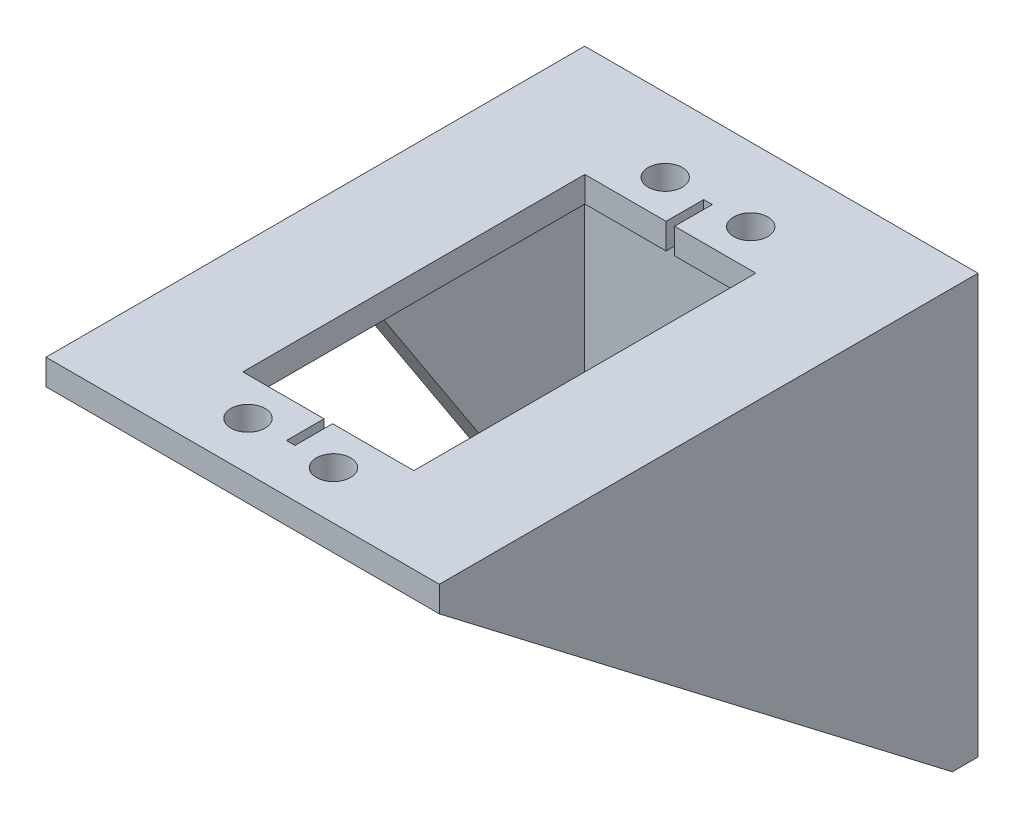
ISO-10303-21;
HEADER;
FILE_DESCRIPTION(('STEP AP214'),'2;1');
FILE_NAME('part.step','',(''),(''),'','','');
FILE_SCHEMA(('AUTOMOTIVE_DESIGN { 1 0 10303 214 1 1 1 1 }'));
ENDSEC;
DATA;
#1=APPLICATION_CONTEXT('core data for automotive mechanical design processes');
#2=APPLICATION_PROTOCOL_DEFINITION('international standard','automotive_design',2000,#1);
#3=PRODUCT_CONTEXT('',#1,'mechanical');
#4=PRODUCT('Part','Part','',(#3));
#5=PRODUCT_RELATED_PRODUCT_CATEGORY('part','',(#4));
#6=PRODUCT_DEFINITION_FORMATION('','',#4);
#7=PRODUCT_DEFINITION_CONTEXT('part definition',#1,'design');
#8=PRODUCT_DEFINITION('design','',#6,#7);
#9=PRODUCT_DEFINITION_SHAPE('','',#8);
#10=(LENGTH_UNIT() NAMED_UNIT(*) SI_UNIT(.MILLI.,.METRE.));
#11=(NAMED_UNIT(*) PLANE_ANGLE_UNIT() SI_UNIT($,.RADIAN.));
#12=(NAMED_UNIT(*) SI_UNIT($,.STERADIAN.) SOLID_ANGLE_UNIT());
#13=UNCERTAINTY_MEASURE_WITH_UNIT(LENGTH_MEASURE(1.E-05),#10,'distance_accuracy_value','');
#14=(GEOMETRIC_REPRESENTATION_CONTEXT(3) GLOBAL_UNCERTAINTY_ASSIGNED_CONTEXT((#13)) GLOBAL_UNIT_ASSIGNED_CONTEXT((#10,
#11,#12)) REPRESENTATION_CONTEXT('',''));
#15=CARTESIAN_POINT('',(0.,0.,0.));
#16=DIRECTION('',(0.,0.,1.));
#17=DIRECTION('',(1.,0.,0.));
#18=AXIS2_PLACEMENT_3D('',#15,#16,#17);
#19=CARTESIAN_POINT('',(0.,0.,3.));
#20=DIRECTION('',(1.,0.,0.));
#21=DIRECTION('',(0.,0.,-1.));
#22=AXIS2_PLACEMENT_3D('',#19,#20,#21);
#23=PLANE('',#22);
#24=DIRECTION('',(0.,0.,-1.));
#25=VECTOR('',#24,1.);
#26=CARTESIAN_POINT('',(0.,0.,3.));
#27=LINE('',#26,#25);
#28=CARTESIAN_POINT('',(0.,0.,3.));
#29=VERTEX_POINT('',#28);
#30=CARTESIAN_POINT('',(0.,0.,0.));
#31=VERTEX_POINT('',#30);
#32=EDGE_CURVE('E628',#29,#31,#27,.T.);
#33=ORIENTED_EDGE('',*,*,#32,.F.);
#34=DIRECTION('',(0.,-0.837610596838614,-0.546267780546922));
#35=VECTOR('',#34,1.);
#36=CARTESIAN_POINT('',(0.,0.,3.));
#37=LINE('',#36,#35);
#38=CARTESIAN_POINT('',(0.,46.,33.));
#39=VERTEX_POINT('',#38);
#40=EDGE_CURVE('E397',#39,#29,#37,.T.);
#41=ORIENTED_EDGE('',*,*,#40,.F.);
#42=DIRECTION('',(0.,0.,1.));
#43=VECTOR('',#42,1.);
#44=CARTESIAN_POINT('',(0.,46.,0.));
#45=LINE('',#44,#43);
#46=CARTESIAN_POINT('',(0.,46.,63.));
#47=VERTEX_POINT('',#46);
#48=EDGE_CURVE('E558',#39,#47,#45,.T.);
#49=ORIENTED_EDGE('',*,*,#48,.T.);
#50=DIRECTION('',(0.,-1.,0.));
#51=VECTOR('',#50,1.);
#52=CARTESIAN_POINT('',(0.,46.,63.));
#53=LINE('',#52,#51);
#54=CARTESIAN_POINT('',(0.,49.,63.));
#55=VERTEX_POINT('',#54);
#56=EDGE_CURVE('E549',#55,#47,#53,.T.);
#57=ORIENTED_EDGE('',*,*,#56,.F.);
#58=DIRECTION('',(0.,0.,1.));
#59=VECTOR('',#58,1.);
#60=CARTESIAN_POINT('',(0.,49.,0.));
#61=LINE('',#60,#59);
#62=CARTESIAN_POINT('',(0.,49.,0.));
#63=VERTEX_POINT('',#62);
#64=EDGE_CURVE('E562',#63,#55,#61,.T.);
#65=ORIENTED_EDGE('',*,*,#64,.F.);
#66=DIRECTION('',(0.,-1.,0.));
#67=VECTOR('',#66,1.);
#68=CARTESIAN_POINT('',(0.,0.,0.));
#69=LINE('',#68,#67);
#70=EDGE_CURVE('E612',#63,#31,#69,.T.);
#71=ORIENTED_EDGE('',*,*,#70,.T.);
#72=EDGE_LOOP('',(#33,#41,#49,#57,#65,#71));
#73=FACE_BOUND('',#72,.T.);
#74=ADVANCED_FACE('F201',(#73),#23,.F.);
#75=CARTESIAN_POINT('',(0.,0.,3.));
#76=DIRECTION('',(0.,1.,0.));
#77=DIRECTION('',(0.,0.,1.));
#78=AXIS2_PLACEMENT_3D('',#75,#76,#77);
#79=PLANE('',#78);
#80=DIRECTION('',(1.,0.,0.));
#81=VECTOR('',#80,1.);
#82=CARTESIAN_POINT('',(-3.,0.,3.));
#83=LINE('',#82,#81);
#84=CARTESIAN_POINT('',(3.,0.,3.));
#85=VERTEX_POINT('',#84);
#86=EDGE_CURVE('E411',#29,#85,#83,.T.);
#87=ORIENTED_EDGE('',*,*,#86,.F.);
#88=ORIENTED_EDGE('',*,*,#32,.T.);
#89=DIRECTION('',(1.,0.,0.));
#90=VECTOR('',#89,1.);
#91=CARTESIAN_POINT('',(0.,0.,0.));
#92=LINE('',#91,#90);
#93=CARTESIAN_POINT('',(46.,0.,0.));
#94=VERTEX_POINT('',#93);
#95=EDGE_CURVE('E616',#31,#94,#92,.T.);
#96=ORIENTED_EDGE('',*,*,#95,.T.);
#97=DIRECTION('',(0.,0.,-1.));
#98=VECTOR('',#97,1.);
#99=CARTESIAN_POINT('',(46.,0.,3.));
#100=LINE('',#99,#98);
#101=CARTESIAN_POINT('',(46.,0.,3.));
#102=VERTEX_POINT('',#101);
#103=EDGE_CURVE('E596',#102,#94,#100,.T.);
#104=ORIENTED_EDGE('',*,*,#103,.F.);
#105=CARTESIAN_POINT('',(43.,0.,3.));
#106=VERTEX_POINT('',#105);
#107=EDGE_CURVE('E408',#106,#102,#83,.T.);
#108=ORIENTED_EDGE('',*,*,#107,.F.);
#109=DIRECTION('',(1.,0.,0.));
#110=VECTOR('',#109,1.);
#111=CARTESIAN_POINT('',(0.,0.,3.));
#112=LINE('',#111,#110);
#113=EDGE_CURVE('E585',#85,#106,#112,.T.);
#114=ORIENTED_EDGE('',*,*,#113,.F.);
#115=EDGE_LOOP('',(#87,#88,#96,#104,#108,#114));
#116=FACE_BOUND('',#115,.T.);
#117=ADVANCED_FACE('F715',(#116),#79,.F.);
#118=CARTESIAN_POINT('',(46.,0.,3.));
#119=DIRECTION('',(-1.,0.,0.));
#120=DIRECTION('',(0.,0.,1.));
#121=AXIS2_PLACEMENT_3D('',#118,#119,#120);
#122=PLANE('',#121);
#123=DIRECTION('',(0.,0.608431543657136,0.793606361291916));
#124=VECTOR('',#123,1.);
#125=CARTESIAN_POINT('',(46.,0.,3.));
#126=LINE('',#125,#124);
#127=CARTESIAN_POINT('',(46.,46.,63.));
#128=VERTEX_POINT('',#127);
#129=EDGE_CURVE('E420',#102,#128,#126,.T.);
#130=ORIENTED_EDGE('',*,*,#129,.F.);
#131=ORIENTED_EDGE('',*,*,#103,.T.);
#132=DIRECTION('',(0.,1.,0.));
#133=VECTOR('',#132,1.);
#134=CARTESIAN_POINT('',(46.,0.,0.));
#135=LINE('',#134,#133);
#136=CARTESIAN_POINT('',(46.,49.,0.));
#137=VERTEX_POINT('',#136);
#138=EDGE_CURVE('E620',#94,#137,#135,.T.);
#139=ORIENTED_EDGE('',*,*,#138,.T.);
#140=DIRECTION('',(0.,0.,1.));
#141=VECTOR('',#140,1.);
#142=CARTESIAN_POINT('',(46.,49.,0.));
#143=LINE('',#142,#141);
#144=CARTESIAN_POINT('',(46.,49.,63.));
#145=VERTEX_POINT('',#144);
#146=EDGE_CURVE('E557',#137,#145,#143,.T.);
#147=ORIENTED_EDGE('',*,*,#146,.T.);
#148=DIRECTION('',(0.,1.,0.));
#149=VECTOR('',#148,1.);
#150=CARTESIAN_POINT('',(46.,49.,63.));
#151=LINE('',#150,#149);
#152=EDGE_CURVE('E541',#128,#145,#151,.T.);
#153=ORIENTED_EDGE('',*,*,#152,.F.);
#154=EDGE_LOOP('',(#130,#131,#139,#147,#153));
#155=FACE_BOUND('',#154,.T.);
#156=ADVANCED_FACE('F722',(#155),#122,.F.);
#157=CARTESIAN_POINT('',(0.,0.,63.));
#158=DIRECTION('',(0.,0.,-1.));
#159=DIRECTION('',(-1.,0.,0.));
#160=AXIS2_PLACEMENT_3D('',#157,#158,#159);
#161=PLANE('',#160);
#162=DIRECTION('',(1.,0.,0.));
#163=VECTOR('',#162,1.);
#164=CARTESIAN_POINT('',(-3.,46.,63.));
#165=LINE('',#164,#163);
#166=CARTESIAN_POINT('',(43.,46.,63.));
#167=VERTEX_POINT('',#166);
#168=EDGE_CURVE('E412',#167,#128,#165,.T.);
#169=ORIENTED_EDGE('',*,*,#168,.T.);
#170=ORIENTED_EDGE('',*,*,#152,.T.);
#171=DIRECTION('',(-1.,0.,0.));
#172=VECTOR('',#171,1.);
#173=CARTESIAN_POINT('',(0.,49.,63.));
#174=LINE('',#173,#172);
#175=EDGE_CURVE('E545',#145,#55,#174,.T.);
#176=ORIENTED_EDGE('',*,*,#175,.T.);
#177=ORIENTED_EDGE('',*,*,#56,.T.);
#178=DIRECTION('',(1.,0.,0.));
#179=VECTOR('',#178,1.);
#180=CARTESIAN_POINT('',(0.,46.,63.));
#181=LINE('',#180,#179);
#182=EDGE_CURVE('E537',#47,#167,#181,.T.);
#183=ORIENTED_EDGE('',*,*,#182,.T.);
#184=EDGE_LOOP('',(#169,#170,#176,#177,#183));
#185=FACE_BOUND('',#184,.T.);
#186=ADVANCED_FACE('F770',(#185),#161,.F.);
#187=CARTESIAN_POINT('',(43.,0.,0.));
#188=DIRECTION('',(-1.,0.,0.));
#189=DIRECTION('',(0.,0.,1.));
#190=AXIS2_PLACEMENT_3D('',#187,#188,#189);
#191=PLANE('',#190);
#192=DIRECTION('',(0.,1.,0.));
#193=VECTOR('',#192,1.);
#194=CARTESIAN_POINT('',(43.,0.,3.));
#195=LINE('',#194,#193);
#196=CARTESIAN_POINT('',(43.,46.,3.));
#197=VERTEX_POINT('',#196);
#198=EDGE_CURVE('E438',#106,#197,#195,.T.);
#199=ORIENTED_EDGE('',*,*,#198,.F.);
#200=DIRECTION('',(0.,0.608431543657136,0.793606361291916));
#201=VECTOR('',#200,1.);
#202=CARTESIAN_POINT('',(43.,-1.44856543037089,1.11056682995102));
#203=LINE('',#202,#201);
#204=EDGE_CURVE('E416',#106,#167,#203,.T.);
#205=ORIENTED_EDGE('',*,*,#204,.T.);
#206=DIRECTION('',(0.,0.,1.));
#207=VECTOR('',#206,1.);
#208=CARTESIAN_POINT('',(43.,46.,0.));
#209=LINE('',#208,#207);
#210=EDGE_CURVE('E434',#197,#167,#209,.T.);
#211=ORIENTED_EDGE('',*,*,#210,.F.);
#212=EDGE_LOOP('',(#199,#205,#211));
#213=FACE_BOUND('',#212,.T.);
#214=ADVANCED_FACE('F775',(#213),#191,.T.);
#215=CARTESIAN_POINT('',(3.,0.,0.));
#216=DIRECTION('',(-1.,0.,0.));
#217=DIRECTION('',(0.,0.,1.));
#218=AXIS2_PLACEMENT_3D('',#215,#216,#217);
#219=PLANE('',#218);
#220=DIRECTION('',(0.,0.,1.));
#221=VECTOR('',#220,1.);
#222=CARTESIAN_POINT('',(3.,46.,0.));
#223=LINE('',#222,#221);
#224=CARTESIAN_POINT('',(3.,46.,3.));
#225=VERTEX_POINT('',#224);
#226=CARTESIAN_POINT('',(3.,46.,33.));
#227=VERTEX_POINT('',#226);
#228=EDGE_CURVE('E423',#225,#227,#223,.T.);
#229=ORIENTED_EDGE('',*,*,#228,.T.);
#230=DIRECTION('',(0.,-0.837610596838614,-0.546267780546922));
#231=VECTOR('',#230,1.);
#232=CARTESIAN_POINT('',(3.,-1.37267904509284,2.10477453580902));
#233=LINE('',#232,#231);
#234=EDGE_CURVE('E404',#227,#85,#233,.T.);
#235=ORIENTED_EDGE('',*,*,#234,.T.);
#236=DIRECTION('',(0.,1.,0.));
#237=VECTOR('',#236,1.);
#238=CARTESIAN_POINT('',(3.,0.,3.));
#239=LINE('',#238,#237);
#240=EDGE_CURVE('E430',#85,#225,#239,.T.);
#241=ORIENTED_EDGE('',*,*,#240,.T.);
#242=EDGE_LOOP('',(#229,#235,#241));
#243=FACE_BOUND('',#242,.T.);
#244=ADVANCED_FACE('F805',(#243),#219,.F.);
#245=CARTESIAN_POINT('',(0.,46.,0.));
#246=DIRECTION('',(0.,-1.,0.));
#247=DIRECTION('',(0.,0.,-1.));
#248=AXIS2_PLACEMENT_3D('',#245,#246,#247);
#249=PLANE('',#248);
#250=DIRECTION('',(-1.,0.,0.));
#251=VECTOR('',#250,1.);
#252=CARTESIAN_POINT('',(0.,46.,33.));
#253=LINE('',#252,#251);
#254=EDGE_CURVE('E427',#227,#39,#253,.T.);
#255=ORIENTED_EDGE('',*,*,#254,.F.);
#256=ORIENTED_EDGE('',*,*,#228,.F.);
#257=DIRECTION('',(-1.,0.,0.));
#258=VECTOR('',#257,1.);
#259=CARTESIAN_POINT('',(0.,46.,3.));
#260=LINE('',#259,#258);
#261=EDGE_CURVE('E588',#197,#225,#260,.T.);
#262=ORIENTED_EDGE('',*,*,#261,.F.);
#263=ORIENTED_EDGE('',*,*,#210,.T.);
#264=ORIENTED_EDGE('',*,*,#182,.F.);
#265=ORIENTED_EDGE('',*,*,#48,.F.);
#266=EDGE_LOOP('',(#255,#256,#262,#263,#264,#265));
#267=FACE_BOUND('',#266,.T.);
#268=CARTESIAN_POINT('',(18.,46.,8.58105442526561));
#269=DIRECTION('',(0.,-1.,0.));
#270=DIRECTION('',(0.,0.,-1.));
#271=AXIS2_PLACEMENT_3D('',#268,#269,#270);
#272=CIRCLE('',#271,2.);
#273=CARTESIAN_POINT('',(18.,46.,6.5810544252656));
#274=VERTEX_POINT('',#273);
#275=EDGE_CURVE('E525',#274,#274,#272,.T.);
#276=ORIENTED_EDGE('',*,*,#275,.F.);
#277=EDGE_LOOP('',(#276));
#278=FACE_BOUND('',#277,.T.);
#279=CARTESIAN_POINT('',(28.,46.,57.3810544252656));
#280=DIRECTION('',(0.,-1.,0.));
#281=DIRECTION('',(0.,0.,-1.));
#282=AXIS2_PLACEMENT_3D('',#279,#280,#281);
#283=CIRCLE('',#282,2.);
#284=CARTESIAN_POINT('',(28.,46.,55.3810544252656));
#285=VERTEX_POINT('',#284);
#286=EDGE_CURVE('E442',#285,#285,#283,.F.);
#287=ORIENTED_EDGE('',*,*,#286,.T.);
#288=EDGE_LOOP('',(#287));
#289=FACE_BOUND('',#288,.T.);
#290=DIRECTION('',(0.,0.,1.));
#291=VECTOR('',#290,1.);
#292=CARTESIAN_POINT('',(23.5,46.,0.));
#293=LINE('',#292,#291);
#294=CARTESIAN_POINT('',(23.5,46.,8.58105442526561));
#295=VERTEX_POINT('',#294);
#296=CARTESIAN_POINT('',(23.5,46.,12.9810544252656));
#297=VERTEX_POINT('',#296);
#298=EDGE_CURVE('E446',#295,#297,#293,.T.);
#299=ORIENTED_EDGE('',*,*,#298,.F.);
#300=DIRECTION('',(1.,0.,0.));
#301=VECTOR('',#300,1.);
#302=CARTESIAN_POINT('',(0.,46.,8.58105442526561));
#303=LINE('',#302,#301);
#304=CARTESIAN_POINT('',(22.5,46.,8.58105442526561));
#305=VERTEX_POINT('',#304);
#306=EDGE_CURVE('E482',#305,#295,#303,.T.);
#307=ORIENTED_EDGE('',*,*,#306,.F.);
#308=DIRECTION('',(0.,0.,-1.));
#309=VECTOR('',#308,1.);
#310=CARTESIAN_POINT('',(22.5,46.,0.));
#311=LINE('',#310,#309);
#312=CARTESIAN_POINT('',(22.5,46.,12.9810544252656));
#313=VERTEX_POINT('',#312);
#314=EDGE_CURVE('E478',#313,#305,#311,.T.);
#315=ORIENTED_EDGE('',*,*,#314,.F.);
#316=DIRECTION('',(-1.,0.,0.));
#317=VECTOR('',#316,1.);
#318=CARTESIAN_POINT('',(0.,46.,12.9810544252656));
#319=LINE('',#318,#317);
#320=CARTESIAN_POINT('',(13.,46.,12.9810544252656));
#321=VERTEX_POINT('',#320);
#322=EDGE_CURVE('E454',#313,#321,#319,.T.);
#323=ORIENTED_EDGE('',*,*,#322,.T.);
#324=DIRECTION('',(0.,0.,-1.));
#325=VECTOR('',#324,1.);
#326=CARTESIAN_POINT('',(13.,46.,0.));
#327=LINE('',#326,#325);
#328=CARTESIAN_POINT('',(13.,46.,52.9810544252656));
#329=VERTEX_POINT('',#328);
#330=EDGE_CURVE('E475',#329,#321,#327,.T.);
#331=ORIENTED_EDGE('',*,*,#330,.F.);
#332=DIRECTION('',(1.,0.,0.));
#333=VECTOR('',#332,1.);
#334=CARTESIAN_POINT('',(0.,46.,52.9810544252656));
#335=LINE('',#334,#333);
#336=CARTESIAN_POINT('',(22.5,46.,52.9810544252656));
#337=VERTEX_POINT('',#336);
#338=EDGE_CURVE('E463',#329,#337,#335,.T.);
#339=ORIENTED_EDGE('',*,*,#338,.T.);
#340=DIRECTION('',(0.,0.,1.));
#341=VECTOR('',#340,1.);
#342=CARTESIAN_POINT('',(22.5,46.,0.));
#343=LINE('',#342,#341);
#344=CARTESIAN_POINT('',(22.5,46.,57.3810544252656));
#345=VERTEX_POINT('',#344);
#346=EDGE_CURVE('E471',#337,#345,#343,.T.);
#347=ORIENTED_EDGE('',*,*,#346,.T.);
#348=DIRECTION('',(1.,0.,0.));
#349=VECTOR('',#348,1.);
#350=CARTESIAN_POINT('',(0.,46.,57.3810544252656));
#351=LINE('',#350,#349);
#352=CARTESIAN_POINT('',(23.5,46.,57.3810544252656));
#353=VERTEX_POINT('',#352);
#354=EDGE_CURVE('E467',#345,#353,#351,.T.);
#355=ORIENTED_EDGE('',*,*,#354,.T.);
#356=DIRECTION('',(0.,0.,-1.));
#357=VECTOR('',#356,1.);
#358=CARTESIAN_POINT('',(23.5,46.,0.));
#359=LINE('',#358,#357);
#360=CARTESIAN_POINT('',(23.5,46.,52.9810544252656));
#361=VERTEX_POINT('',#360);
#362=EDGE_CURVE('E462',#353,#361,#359,.T.);
#363=ORIENTED_EDGE('',*,*,#362,.T.);
#364=CARTESIAN_POINT('',(33.,46.,52.9810544252656));
#365=VERTEX_POINT('',#364);
#366=EDGE_CURVE('E458',#361,#365,#335,.T.);
#367=ORIENTED_EDGE('',*,*,#366,.T.);
#368=DIRECTION('',(0.,0.,1.));
#369=VECTOR('',#368,1.);
#370=CARTESIAN_POINT('',(33.,46.,0.));
#371=LINE('',#370,#369);
#372=CARTESIAN_POINT('',(33.,46.,12.9810544252656));
#373=VERTEX_POINT('',#372);
#374=EDGE_CURVE('E453',#373,#365,#371,.T.);
#375=ORIENTED_EDGE('',*,*,#374,.F.);
#376=EDGE_CURVE('E449',#373,#297,#319,.T.);
#377=ORIENTED_EDGE('',*,*,#376,.T.);
#378=EDGE_LOOP('',(#299,#307,#315,#323,#331,#339,#347,#355,#363,#367,#375,#377));
#379=FACE_BOUND('',#378,.T.);
#380=CARTESIAN_POINT('',(28.,46.,8.58105442526561));
#381=DIRECTION('',(0.,-1.,0.));
#382=DIRECTION('',(0.,0.,-1.));
#383=AXIS2_PLACEMENT_3D('',#380,#381,#382);
#384=CIRCLE('',#383,2.);
#385=CARTESIAN_POINT('',(28.,46.,6.58105442526561));
#386=VERTEX_POINT('',#385);
#387=EDGE_CURVE('E529',#386,#386,#384,.T.);
#388=ORIENTED_EDGE('',*,*,#387,.F.);
#389=EDGE_LOOP('',(#388));
#390=FACE_BOUND('',#389,.T.);
#391=CARTESIAN_POINT('',(18.,46.,57.3810544252656));
#392=DIRECTION('',(0.,-1.,0.));
#393=DIRECTION('',(0.,0.,-1.));
#394=AXIS2_PLACEMENT_3D('',#391,#392,#393);
#395=CIRCLE('',#394,2.);
#396=CARTESIAN_POINT('',(18.,46.,55.3810544252656));
#397=VERTEX_POINT('',#396);
#398=EDGE_CURVE('E490',#397,#397,#395,.F.);
#399=ORIENTED_EDGE('',*,*,#398,.T.);
#400=EDGE_LOOP('',(#399));
#401=FACE_BOUND('',#400,.T.);
#402=ADVANCED_FACE('F797',(#267,#278,#289,#379,#390,#401),#249,.T.);
#403=CARTESIAN_POINT('',(0.,0.,3.));
#404=DIRECTION('',(0.,0.,1.));
#405=DIRECTION('',(1.,0.,0.));
#406=AXIS2_PLACEMENT_3D('',#403,#404,#405);
#407=PLANE('',#406);
#408=DIRECTION('',(0.,1.,0.));
#409=VECTOR('',#408,1.);
#410=CARTESIAN_POINT('',(38.5,0.,3.));
#411=LINE('',#410,#409);
#412=CARTESIAN_POINT('',(38.5,37.,3.));
#413=VERTEX_POINT('',#412);
#414=CARTESIAN_POINT('',(38.5,40.,3.));
#415=VERTEX_POINT('',#414);
#416=EDGE_CURVE('E217',#413,#415,#411,.T.);
#417=ORIENTED_EDGE('',*,*,#416,.F.);
#418=DIRECTION('',(1.,0.,0.));
#419=VECTOR('',#418,1.);
#420=CARTESIAN_POINT('',(0.,37.,3.));
#421=LINE('',#420,#419);
#422=CARTESIAN_POINT('',(29.5,37.,3.));
#423=VERTEX_POINT('',#422);
#424=EDGE_CURVE('E387',#423,#413,#421,.T.);
#425=ORIENTED_EDGE('',*,*,#424,.F.);
#426=DIRECTION('',(0.,-1.,0.));
#427=VECTOR('',#426,1.);
#428=CARTESIAN_POINT('',(29.5,0.,3.));
#429=LINE('',#428,#427);
#430=CARTESIAN_POINT('',(29.5,40.,3.));
#431=VERTEX_POINT('',#430);
#432=EDGE_CURVE('E369',#431,#423,#429,.T.);
#433=ORIENTED_EDGE('',*,*,#432,.F.);
#434=DIRECTION('',(-1.,0.,0.));
#435=VECTOR('',#434,1.);
#436=CARTESIAN_POINT('',(0.,40.,3.));
#437=LINE('',#436,#435);
#438=EDGE_CURVE('E379',#415,#431,#437,.T.);
#439=ORIENTED_EDGE('',*,*,#438,.F.);
#440=EDGE_LOOP('',(#417,#425,#433,#439));
#441=FACE_BOUND('',#440,.T.);
#442=CARTESIAN_POINT('',(23.,16.,3.));
#443=DIRECTION('',(0.,0.,1.));
#444=DIRECTION('',(1.,0.,0.));
#445=AXIS2_PLACEMENT_3D('',#442,#443,#444);
#446=CIRCLE('',#445,0.750000000000002);
#447=CARTESIAN_POINT('',(23.75,16.,3.));
#448=VERTEX_POINT('',#447);
#449=EDGE_CURVE('E568',#448,#448,#446,.T.);
#450=ORIENTED_EDGE('',*,*,#449,.F.);
#451=EDGE_LOOP('',(#450));
#452=FACE_BOUND('',#451,.T.);
#453=CARTESIAN_POINT('',(16.,23.,3.));
#454=DIRECTION('',(0.,0.,1.));
#455=DIRECTION('',(1.,0.,0.));
#456=AXIS2_PLACEMENT_3D('',#453,#454,#455);
#457=CIRCLE('',#456,0.750000000000002);
#458=CARTESIAN_POINT('',(16.75,23.,3.));
#459=VERTEX_POINT('',#458);
#460=EDGE_CURVE('E572',#459,#459,#457,.T.);
#461=ORIENTED_EDGE('',*,*,#460,.F.);
#462=EDGE_LOOP('',(#461));
#463=FACE_BOUND('',#462,.T.);
#464=CARTESIAN_POINT('',(23.,30.,3.));
#465=DIRECTION('',(0.,0.,1.));
#466=DIRECTION('',(1.,0.,0.));
#467=AXIS2_PLACEMENT_3D('',#464,#465,#466);
#468=CIRCLE('',#467,0.750000000000002);
#469=CARTESIAN_POINT('',(23.75,30.,3.));
#470=VERTEX_POINT('',#469);
#471=EDGE_CURVE('E577',#470,#470,#468,.T.);
#472=ORIENTED_EDGE('',*,*,#471,.F.);
#473=EDGE_LOOP('',(#472));
#474=FACE_BOUND('',#473,.T.);
#475=CARTESIAN_POINT('',(30.,23.,3.));
#476=DIRECTION('',(0.,0.,1.));
#477=DIRECTION('',(1.,0.,0.));
#478=AXIS2_PLACEMENT_3D('',#475,#476,#477);
#479=CIRCLE('',#478,0.750000000000002);
#480=CARTESIAN_POINT('',(30.75,23.,3.));
#481=VERTEX_POINT('',#480);
#482=EDGE_CURVE('E581',#481,#481,#479,.T.);
#483=ORIENTED_EDGE('',*,*,#482,.F.);
#484=EDGE_LOOP('',(#483));
#485=FACE_BOUND('',#484,.T.);
#486=CARTESIAN_POINT('',(23.,23.,3.));
#487=DIRECTION('',(0.,0.,1.));
#488=DIRECTION('',(1.,0.,0.));
#489=AXIS2_PLACEMENT_3D('',#486,#487,#488);
#490=CIRCLE('',#489,3.);
#491=CARTESIAN_POINT('',(26.,23.,3.));
#492=VERTEX_POINT('',#491);
#493=EDGE_CURVE('E592',#492,#492,#490,.T.);
#494=ORIENTED_EDGE('',*,*,#493,.F.);
#495=EDGE_LOOP('',(#494));
#496=FACE_BOUND('',#495,.T.);
#497=ORIENTED_EDGE('',*,*,#261,.T.);
#498=ORIENTED_EDGE('',*,*,#240,.F.);
#499=ORIENTED_EDGE('',*,*,#113,.T.);
#500=ORIENTED_EDGE('',*,*,#198,.T.);
#501=EDGE_LOOP('',(#497,#498,#499,#500));
#502=FACE_BOUND('',#501,.T.);
#503=ADVANCED_FACE('F384',(#441,#452,#463,#474,#485,#496,#502),#407,.T.);
#504=CARTESIAN_POINT('',(0.,49.,0.));
#505=DIRECTION('',(0.,1.,0.));
#506=DIRECTION('',(0.,0.,1.));
#507=AXIS2_PLACEMENT_3D('',#504,#505,#506);
#508=PLANE('',#507);
#509=CARTESIAN_POINT('',(18.,49.,8.58105442526561));
#510=DIRECTION('',(0.,1.,0.));
#511=DIRECTION('',(0.,0.,1.));
#512=AXIS2_PLACEMENT_3D('',#509,#510,#511);
#513=CIRCLE('',#512,2.);
#514=CARTESIAN_POINT('',(18.,49.,10.5810544252656));
#515=VERTEX_POINT('',#514);
#516=EDGE_CURVE('E542',#515,#515,#513,.T.);
#517=ORIENTED_EDGE('',*,*,#516,.F.);
#518=EDGE_LOOP('',(#517));
#519=FACE_BOUND('',#518,.T.);
#520=CARTESIAN_POINT('',(28.,49.,57.3810544252656));
#521=DIRECTION('',(0.,1.,0.));
#522=DIRECTION('',(0.,0.,1.));
#523=AXIS2_PLACEMENT_3D('',#520,#521,#522);
#524=CIRCLE('',#523,2.);
#525=CARTESIAN_POINT('',(28.,49.,59.3810544252656));
#526=VERTEX_POINT('',#525);
#527=EDGE_CURVE('E635',#526,#526,#524,.F.);
#528=ORIENTED_EDGE('',*,*,#527,.T.);
#529=EDGE_LOOP('',(#528));
#530=FACE_BOUND('',#529,.T.);
#531=DIRECTION('',(0.,0.,-1.));
#532=VECTOR('',#531,1.);
#533=CARTESIAN_POINT('',(23.5,49.,0.));
#534=LINE('',#533,#532);
#535=CARTESIAN_POINT('',(23.5,49.,12.9810544252656));
#536=VERTEX_POINT('',#535);
#537=CARTESIAN_POINT('',(23.5,49.,8.58105442526561));
#538=VERTEX_POINT('',#537);
#539=EDGE_CURVE('E676',#536,#538,#534,.T.);
#540=ORIENTED_EDGE('',*,*,#539,.F.);
#541=DIRECTION('',(1.,0.,0.));
#542=VECTOR('',#541,1.);
#543=CARTESIAN_POINT('',(0.,49.,12.9810544252656));
#544=LINE('',#543,#542);
#545=CARTESIAN_POINT('',(33.,49.,12.9810544252656));
#546=VERTEX_POINT('',#545);
#547=EDGE_CURVE('E631',#536,#546,#544,.T.);
#548=ORIENTED_EDGE('',*,*,#547,.T.);
#549=DIRECTION('',(0.,0.,-1.));
#550=VECTOR('',#549,1.);
#551=CARTESIAN_POINT('',(33.,49.,0.));
#552=LINE('',#551,#550);
#553=CARTESIAN_POINT('',(33.,49.,52.9810544252656));
#554=VERTEX_POINT('',#553);
#555=EDGE_CURVE('E639',#554,#546,#552,.T.);
#556=ORIENTED_EDGE('',*,*,#555,.F.);
#557=DIRECTION('',(-1.,0.,0.));
#558=VECTOR('',#557,1.);
#559=CARTESIAN_POINT('',(0.,49.,52.9810544252656));
#560=LINE('',#559,#558);
#561=CARTESIAN_POINT('',(23.5,49.,52.9810544252656));
#562=VERTEX_POINT('',#561);
#563=EDGE_CURVE('E643',#554,#562,#560,.T.);
#564=ORIENTED_EDGE('',*,*,#563,.T.);
#565=DIRECTION('',(0.,0.,1.));
#566=VECTOR('',#565,1.);
#567=CARTESIAN_POINT('',(23.5,49.,0.));
#568=LINE('',#567,#566);
#569=CARTESIAN_POINT('',(23.5,49.,57.3810544252656));
#570=VERTEX_POINT('',#569);
#571=EDGE_CURVE('E647',#562,#570,#568,.T.);
#572=ORIENTED_EDGE('',*,*,#571,.T.);
#573=DIRECTION('',(-1.,0.,0.));
#574=VECTOR('',#573,1.);
#575=CARTESIAN_POINT('',(0.,49.,57.3810544252656));
#576=LINE('',#575,#574);
#577=CARTESIAN_POINT('',(22.5,49.,57.3810544252656));
#578=VERTEX_POINT('',#577);
#579=EDGE_CURVE('E651',#570,#578,#576,.T.);
#580=ORIENTED_EDGE('',*,*,#579,.T.);
#581=DIRECTION('',(0.,0.,-1.));
#582=VECTOR('',#581,1.);
#583=CARTESIAN_POINT('',(22.5,49.,0.));
#584=LINE('',#583,#582);
#585=CARTESIAN_POINT('',(22.5,49.,52.9810544252656));
#586=VERTEX_POINT('',#585);
#587=EDGE_CURVE('E655',#578,#586,#584,.T.);
#588=ORIENTED_EDGE('',*,*,#587,.T.);
#589=DIRECTION('',(-1.,0.,0.));
#590=VECTOR('',#589,1.);
#591=CARTESIAN_POINT('',(0.,49.,52.9810544252656));
#592=LINE('',#591,#590);
#593=CARTESIAN_POINT('',(13.,49.,52.9810544252656));
#594=VERTEX_POINT('',#593);
#595=EDGE_CURVE('E659',#586,#594,#592,.T.);
#596=ORIENTED_EDGE('',*,*,#595,.T.);
#597=DIRECTION('',(0.,0.,1.));
#598=VECTOR('',#597,1.);
#599=CARTESIAN_POINT('',(13.,49.,0.));
#600=LINE('',#599,#598);
#601=CARTESIAN_POINT('',(13.,49.,12.9810544252656));
#602=VERTEX_POINT('',#601);
#603=EDGE_CURVE('E663',#602,#594,#600,.T.);
#604=ORIENTED_EDGE('',*,*,#603,.F.);
#605=DIRECTION('',(1.,0.,0.));
#606=VECTOR('',#605,1.);
#607=CARTESIAN_POINT('',(0.,49.,12.9810544252656));
#608=LINE('',#607,#606);
#609=CARTESIAN_POINT('',(22.5,49.,12.9810544252656));
#610=VERTEX_POINT('',#609);
#611=EDGE_CURVE('E666',#602,#610,#608,.T.);
#612=ORIENTED_EDGE('',*,*,#611,.T.);
#613=DIRECTION('',(0.,0.,1.));
#614=VECTOR('',#613,1.);
#615=CARTESIAN_POINT('',(22.5,49.,0.));
#616=LINE('',#615,#614);
#617=CARTESIAN_POINT('',(22.5,49.,8.58105442526561));
#618=VERTEX_POINT('',#617);
#619=EDGE_CURVE('E670',#618,#610,#616,.T.);
#620=ORIENTED_EDGE('',*,*,#619,.F.);
#621=DIRECTION('',(-1.,0.,0.));
#622=VECTOR('',#621,1.);
#623=CARTESIAN_POINT('',(0.,49.,8.58105442526561));
#624=LINE('',#623,#622);
#625=EDGE_CURVE('E673',#538,#618,#624,.T.);
#626=ORIENTED_EDGE('',*,*,#625,.F.);
#627=EDGE_LOOP('',(#540,#548,#556,#564,#572,#580,#588,#596,#604,#612,#620,#626));
#628=FACE_BOUND('',#627,.T.);
#629=CARTESIAN_POINT('',(28.,49.,8.58105442526561));
#630=DIRECTION('',(0.,1.,0.));
#631=DIRECTION('',(0.,0.,1.));
#632=AXIS2_PLACEMENT_3D('',#629,#630,#631);
#633=CIRCLE('',#632,2.);
#634=CARTESIAN_POINT('',(28.,49.,10.5810544252656));
#635=VERTEX_POINT('',#634);
#636=EDGE_CURVE('E536',#635,#635,#633,.T.);
#637=ORIENTED_EDGE('',*,*,#636,.F.);
#638=EDGE_LOOP('',(#637));
#639=FACE_BOUND('',#638,.T.);
#640=ORIENTED_EDGE('',*,*,#64,.T.);
#641=ORIENTED_EDGE('',*,*,#175,.F.);
#642=ORIENTED_EDGE('',*,*,#146,.F.);
#643=DIRECTION('',(-1.,0.,0.));
#644=VECTOR('',#643,1.);
#645=CARTESIAN_POINT('',(0.,49.,0.));
#646=LINE('',#645,#644);
#647=EDGE_CURVE('E553',#137,#63,#646,.T.);
#648=ORIENTED_EDGE('',*,*,#647,.T.);
#649=EDGE_LOOP('',(#640,#641,#642,#648));
#650=FACE_BOUND('',#649,.T.);
#651=CARTESIAN_POINT('',(18.,49.,57.3810544252656));
#652=DIRECTION('',(0.,1.,0.));
#653=DIRECTION('',(0.,0.,1.));
#654=AXIS2_PLACEMENT_3D('',#651,#652,#653);
#655=CIRCLE('',#654,2.);
#656=CARTESIAN_POINT('',(18.,49.,59.3810544252656));
#657=VERTEX_POINT('',#656);
#658=EDGE_CURVE('E683',#657,#657,#655,.F.);
#659=ORIENTED_EDGE('',*,*,#658,.T.);
#660=EDGE_LOOP('',(#659));
#661=FACE_BOUND('',#660,.T.);
#662=ADVANCED_FACE('F732',(#519,#530,#628,#639,#650,#661),#508,.T.);
#663=CARTESIAN_POINT('',(30.,23.,3.));
#664=DIRECTION('',(0.,0.,-1.));
#665=DIRECTION('',(-1.,0.,0.));
#666=AXIS2_PLACEMENT_3D('',#663,#664,#665);
#667=CYLINDRICAL_SURFACE('',#666,0.750000000000002);
#668=ORIENTED_EDGE('',*,*,#482,.T.);
#669=EDGE_LOOP('',(#668));
#670=FACE_BOUND('',#669,.T.);
#671=CARTESIAN_POINT('',(30.,23.,0.));
#672=DIRECTION('',(0.,0.,1.));
#673=DIRECTION('',(1.,0.,0.));
#674=AXIS2_PLACEMENT_3D('',#671,#672,#673);
#675=CIRCLE('',#674,0.750000000000002);
#676=CARTESIAN_POINT('',(30.75,23.,0.));
#677=VERTEX_POINT('',#676);
#678=EDGE_CURVE('E608',#677,#677,#675,.T.);
#679=ORIENTED_EDGE('',*,*,#678,.F.);
#680=EDGE_LOOP('',(#679));
#681=FACE_BOUND('',#680,.T.);
#682=ADVANCED_FACE('F728',(#670,#681),#667,.F.);
#683=CARTESIAN_POINT('',(23.,30.,3.));
#684=DIRECTION('',(0.,0.,-1.));
#685=DIRECTION('',(-1.,0.,0.));
#686=AXIS2_PLACEMENT_3D('',#683,#684,#685);
#687=CYLINDRICAL_SURFACE('',#686,0.750000000000002);
#688=ORIENTED_EDGE('',*,*,#471,.T.);
#689=EDGE_LOOP('',(#688));
#690=FACE_BOUND('',#689,.T.);
#691=CARTESIAN_POINT('',(23.,30.,0.));
#692=DIRECTION('',(0.,0.,1.));
#693=DIRECTION('',(1.,0.,0.));
#694=AXIS2_PLACEMENT_3D('',#691,#692,#693);
#695=CIRCLE('',#694,0.750000000000002);
#696=CARTESIAN_POINT('',(23.75,30.,0.));
#697=VERTEX_POINT('',#696);
#698=EDGE_CURVE('E604',#697,#697,#695,.T.);
#699=ORIENTED_EDGE('',*,*,#698,.F.);
#700=EDGE_LOOP('',(#699));
#701=FACE_BOUND('',#700,.T.);
#702=ADVANCED_FACE('F731',(#690,#701),#687,.F.);
#703=CARTESIAN_POINT('',(16.,23.,3.));
#704=DIRECTION('',(0.,0.,-1.));
#705=DIRECTION('',(-1.,0.,0.));
#706=AXIS2_PLACEMENT_3D('',#703,#704,#705);
#707=CYLINDRICAL_SURFACE('',#706,0.750000000000002);
#708=ORIENTED_EDGE('',*,*,#460,.T.);
#709=EDGE_LOOP('',(#708));
#710=FACE_BOUND('',#709,.T.);
#711=CARTESIAN_POINT('',(16.,23.,0.));
#712=DIRECTION('',(0.,0.,1.));
#713=DIRECTION('',(1.,0.,0.));
#714=AXIS2_PLACEMENT_3D('',#711,#712,#713);
#715=CIRCLE('',#714,0.750000000000002);
#716=CARTESIAN_POINT('',(16.75,23.,0.));
#717=VERTEX_POINT('',#716);
#718=EDGE_CURVE('E600',#717,#717,#715,.T.);
#719=ORIENTED_EDGE('',*,*,#718,.F.);
#720=EDGE_LOOP('',(#719));
#721=FACE_BOUND('',#720,.T.);
#722=ADVANCED_FACE('F735',(#710,#721),#707,.F.);
#723=CARTESIAN_POINT('',(23.,16.,3.));
#724=DIRECTION('',(0.,0.,-1.));
#725=DIRECTION('',(-1.,0.,0.));
#726=AXIS2_PLACEMENT_3D('',#723,#724,#725);
#727=CYLINDRICAL_SURFACE('',#726,0.750000000000002);
#728=ORIENTED_EDGE('',*,*,#449,.T.);
#729=EDGE_LOOP('',(#728));
#730=FACE_BOUND('',#729,.T.);
#731=CARTESIAN_POINT('',(23.,16.,0.));
#732=DIRECTION('',(0.,0.,1.));
#733=DIRECTION('',(1.,0.,0.));
#734=AXIS2_PLACEMENT_3D('',#731,#732,#733);
#735=CIRCLE('',#734,0.750000000000002);
#736=CARTESIAN_POINT('',(23.75,16.,0.));
#737=VERTEX_POINT('',#736);
#738=EDGE_CURVE('E561',#737,#737,#735,.T.);
#739=ORIENTED_EDGE('',*,*,#738,.F.);
#740=EDGE_LOOP('',(#739));
#741=FACE_BOUND('',#740,.T.);
#742=ADVANCED_FACE('F203',(#730,#741),#727,.F.);
#743=CARTESIAN_POINT('',(23.,23.,3.));
#744=DIRECTION('',(0.,0.,-1.));
#745=DIRECTION('',(-1.,0.,0.));
#746=AXIS2_PLACEMENT_3D('',#743,#744,#745);
#747=CYLINDRICAL_SURFACE('',#746,3.);
#748=ORIENTED_EDGE('',*,*,#493,.T.);
#749=EDGE_LOOP('',(#748));
#750=FACE_BOUND('',#749,.T.);
#751=CARTESIAN_POINT('',(23.,23.,0.));
#752=DIRECTION('',(0.,0.,1.));
#753=DIRECTION('',(1.,0.,0.));
#754=AXIS2_PLACEMENT_3D('',#751,#752,#753);
#755=CIRCLE('',#754,3.);
#756=CARTESIAN_POINT('',(26.,23.,0.));
#757=VERTEX_POINT('',#756);
#758=EDGE_CURVE('E573',#757,#757,#755,.T.);
#759=ORIENTED_EDGE('',*,*,#758,.F.);
#760=EDGE_LOOP('',(#759));
#761=FACE_BOUND('',#760,.T.);
#762=ADVANCED_FACE('F742',(#750,#761),#747,.F.);
#763=CARTESIAN_POINT('',(0.,0.,0.));
#764=DIRECTION('',(0.,0.,1.));
#765=DIRECTION('',(1.,0.,0.));
#766=AXIS2_PLACEMENT_3D('',#763,#764,#765);
#767=PLANE('',#766);
#768=DIRECTION('',(1.,0.,0.));
#769=VECTOR('',#768,1.);
#770=CARTESIAN_POINT('',(0.,37.,0.));
#771=LINE('',#770,#769);
#772=CARTESIAN_POINT('',(29.5,37.,0.));
#773=VERTEX_POINT('',#772);
#774=CARTESIAN_POINT('',(38.5,37.,0.));
#775=VERTEX_POINT('',#774);
#776=EDGE_CURVE('E210',#773,#775,#771,.T.);
#777=ORIENTED_EDGE('',*,*,#776,.T.);
#778=DIRECTION('',(0.,1.,0.));
#779=VECTOR('',#778,1.);
#780=CARTESIAN_POINT('',(38.5,0.,0.));
#781=LINE('',#780,#779);
#782=CARTESIAN_POINT('',(38.5,40.,0.));
#783=VERTEX_POINT('',#782);
#784=EDGE_CURVE('E12',#775,#783,#781,.T.);
#785=ORIENTED_EDGE('',*,*,#784,.T.);
#786=DIRECTION('',(-1.,0.,0.));
#787=VECTOR('',#786,1.);
#788=CARTESIAN_POINT('',(0.,40.,0.));
#789=LINE('',#788,#787);
#790=CARTESIAN_POINT('',(29.5,40.,0.));
#791=VERTEX_POINT('',#790);
#792=EDGE_CURVE('E679',#783,#791,#789,.T.);
#793=ORIENTED_EDGE('',*,*,#792,.T.);
#794=DIRECTION('',(0.,-1.,0.));
#795=VECTOR('',#794,1.);
#796=CARTESIAN_POINT('',(29.5,0.,0.));
#797=LINE('',#796,#795);
#798=EDGE_CURVE('E372',#791,#773,#797,.T.);
#799=ORIENTED_EDGE('',*,*,#798,.T.);
#800=EDGE_LOOP('',(#777,#785,#793,#799));
#801=FACE_BOUND('',#800,.T.);
#802=ORIENTED_EDGE('',*,*,#738,.T.);
#803=EDGE_LOOP('',(#802));
#804=FACE_BOUND('',#803,.T.);
#805=ORIENTED_EDGE('',*,*,#718,.T.);
#806=EDGE_LOOP('',(#805));
#807=FACE_BOUND('',#806,.T.);
#808=ORIENTED_EDGE('',*,*,#698,.T.);
#809=EDGE_LOOP('',(#808));
#810=FACE_BOUND('',#809,.T.);
#811=ORIENTED_EDGE('',*,*,#678,.T.);
#812=EDGE_LOOP('',(#811));
#813=FACE_BOUND('',#812,.T.);
#814=ORIENTED_EDGE('',*,*,#70,.F.);
#815=ORIENTED_EDGE('',*,*,#647,.F.);
#816=ORIENTED_EDGE('',*,*,#138,.F.);
#817=ORIENTED_EDGE('',*,*,#95,.F.);
#818=EDGE_LOOP('',(#814,#815,#816,#817));
#819=FACE_BOUND('',#818,.T.);
#820=ORIENTED_EDGE('',*,*,#758,.T.);
#821=EDGE_LOOP('',(#820));
#822=FACE_BOUND('',#821,.T.);
#823=ADVANCED_FACE('F696',(#801,#804,#807,#810,#813,#819,#822),#767,.F.);
#824=CARTESIAN_POINT('',(28.,56.,8.58105442526561));
#825=DIRECTION('',(0.,-1.,0.));
#826=DIRECTION('',(0.,0.,-1.));
#827=AXIS2_PLACEMENT_3D('',#824,#825,#826);
#828=CYLINDRICAL_SURFACE('',#827,2.);
#829=ORIENTED_EDGE('',*,*,#636,.T.);
#830=EDGE_LOOP('',(#829));
#831=FACE_BOUND('',#830,.T.);
#832=ORIENTED_EDGE('',*,*,#387,.T.);
#833=EDGE_LOOP('',(#832));
#834=FACE_BOUND('',#833,.T.);
#835=ADVANCED_FACE('F750',(#831,#834),#828,.F.);
#836=CARTESIAN_POINT('',(23.5,56.,0.));
#837=DIRECTION('',(1.,0.,0.));
#838=DIRECTION('',(0.,0.,-1.));
#839=AXIS2_PLACEMENT_3D('',#836,#837,#838);
#840=PLANE('',#839);
#841=ORIENTED_EDGE('',*,*,#539,.T.);
#842=DIRECTION('',(0.,-1.,0.));
#843=VECTOR('',#842,1.);
#844=CARTESIAN_POINT('',(23.5,56.,8.58105442526561));
#845=LINE('',#844,#843);
#846=EDGE_CURVE('E487',#538,#295,#845,.T.);
#847=ORIENTED_EDGE('',*,*,#846,.T.);
#848=ORIENTED_EDGE('',*,*,#298,.T.);
#849=DIRECTION('',(0.,-1.,0.));
#850=VECTOR('',#849,1.);
#851=CARTESIAN_POINT('',(23.5,56.,12.9810544252656));
#852=LINE('',#851,#850);
#853=EDGE_CURVE('E486',#536,#297,#852,.T.);
#854=ORIENTED_EDGE('',*,*,#853,.F.);
#855=EDGE_LOOP('',(#841,#847,#848,#854));
#856=FACE_BOUND('',#855,.T.);
#857=ADVANCED_FACE('F859',(#856),#840,.F.);
#858=CARTESIAN_POINT('',(0.,56.,8.58105442526561));
#859=DIRECTION('',(0.,0.,-1.));
#860=DIRECTION('',(-1.,0.,0.));
#861=AXIS2_PLACEMENT_3D('',#858,#859,#860);
#862=PLANE('',#861);
#863=ORIENTED_EDGE('',*,*,#625,.T.);
#864=DIRECTION('',(0.,-1.,0.));
#865=VECTOR('',#864,1.);
#866=CARTESIAN_POINT('',(22.5,56.,8.58105442526561));
#867=LINE('',#866,#865);
#868=EDGE_CURVE('E491',#618,#305,#867,.T.);
#869=ORIENTED_EDGE('',*,*,#868,.T.);
#870=ORIENTED_EDGE('',*,*,#306,.T.);
#871=ORIENTED_EDGE('',*,*,#846,.F.);
#872=EDGE_LOOP('',(#863,#869,#870,#871));
#873=FACE_BOUND('',#872,.T.);
#874=ADVANCED_FACE('F864',(#873),#862,.F.);
#875=CARTESIAN_POINT('',(22.5,56.,0.));
#876=DIRECTION('',(-1.,0.,0.));
#877=DIRECTION('',(0.,0.,1.));
#878=AXIS2_PLACEMENT_3D('',#875,#876,#877);
#879=PLANE('',#878);
#880=ORIENTED_EDGE('',*,*,#619,.T.);
#881=DIRECTION('',(0.,-1.,0.));
#882=VECTOR('',#881,1.);
#883=CARTESIAN_POINT('',(22.5,56.,12.9810544252656));
#884=LINE('',#883,#882);
#885=EDGE_CURVE('E494',#610,#313,#884,.T.);
#886=ORIENTED_EDGE('',*,*,#885,.T.);
#887=ORIENTED_EDGE('',*,*,#314,.T.);
#888=ORIENTED_EDGE('',*,*,#868,.F.);
#889=EDGE_LOOP('',(#880,#886,#887,#888));
#890=FACE_BOUND('',#889,.T.);
#891=ADVANCED_FACE('F866',(#890),#879,.F.);
#892=CARTESIAN_POINT('',(0.,56.,12.9810544252656));
#893=DIRECTION('',(0.,0.,1.));
#894=DIRECTION('',(1.,0.,0.));
#895=AXIS2_PLACEMENT_3D('',#892,#893,#894);
#896=PLANE('',#895);
#897=DIRECTION('',(0.,-1.,0.));
#898=VECTOR('',#897,1.);
#899=CARTESIAN_POINT('',(13.,56.,12.9810544252656));
#900=LINE('',#899,#898);
#901=EDGE_CURVE('E497',#602,#321,#900,.T.);
#902=ORIENTED_EDGE('',*,*,#901,.T.);
#903=ORIENTED_EDGE('',*,*,#322,.F.);
#904=ORIENTED_EDGE('',*,*,#885,.F.);
#905=ORIENTED_EDGE('',*,*,#611,.F.);
#906=EDGE_LOOP('',(#902,#903,#904,#905));
#907=FACE_BOUND('',#906,.T.);
#908=ADVANCED_FACE('F820',(#907),#896,.T.);
#909=CARTESIAN_POINT('',(13.,56.,0.));
#910=DIRECTION('',(-1.,0.,0.));
#911=DIRECTION('',(0.,0.,1.));
#912=AXIS2_PLACEMENT_3D('',#909,#910,#911);
#913=PLANE('',#912);
#914=ORIENTED_EDGE('',*,*,#603,.T.);
#915=DIRECTION('',(0.,-1.,0.));
#916=VECTOR('',#915,1.);
#917=CARTESIAN_POINT('',(13.,56.,52.9810544252656));
#918=LINE('',#917,#916);
#919=EDGE_CURVE('E501',#594,#329,#918,.T.);
#920=ORIENTED_EDGE('',*,*,#919,.T.);
#921=ORIENTED_EDGE('',*,*,#330,.T.);
#922=ORIENTED_EDGE('',*,*,#901,.F.);
#923=EDGE_LOOP('',(#914,#920,#921,#922));
#924=FACE_BOUND('',#923,.T.);
#925=ADVANCED_FACE('F824',(#924),#913,.F.);
#926=CARTESIAN_POINT('',(0.,56.,52.9810544252656));
#927=DIRECTION('',(0.,0.,-1.));
#928=DIRECTION('',(-1.,0.,0.));
#929=AXIS2_PLACEMENT_3D('',#926,#927,#928);
#930=PLANE('',#929);
#931=DIRECTION('',(0.,-1.,0.));
#932=VECTOR('',#931,1.);
#933=CARTESIAN_POINT('',(22.5,56.,52.9810544252656));
#934=LINE('',#933,#932);
#935=EDGE_CURVE('E504',#586,#337,#934,.T.);
#936=ORIENTED_EDGE('',*,*,#935,.T.);
#937=ORIENTED_EDGE('',*,*,#338,.F.);
#938=ORIENTED_EDGE('',*,*,#919,.F.);
#939=ORIENTED_EDGE('',*,*,#595,.F.);
#940=EDGE_LOOP('',(#936,#937,#938,#939));
#941=FACE_BOUND('',#940,.T.);
#942=ADVANCED_FACE('F832',(#941),#930,.T.);
#943=CARTESIAN_POINT('',(22.5,56.,0.));
#944=DIRECTION('',(1.,0.,0.));
#945=DIRECTION('',(0.,0.,-1.));
#946=AXIS2_PLACEMENT_3D('',#943,#944,#945);
#947=PLANE('',#946);
#948=DIRECTION('',(0.,-1.,0.));
#949=VECTOR('',#948,1.);
#950=CARTESIAN_POINT('',(22.5,56.,57.3810544252656));
#951=LINE('',#950,#949);
#952=EDGE_CURVE('E507',#578,#345,#951,.T.);
#953=ORIENTED_EDGE('',*,*,#952,.T.);
#954=ORIENTED_EDGE('',*,*,#346,.F.);
#955=ORIENTED_EDGE('',*,*,#935,.F.);
#956=ORIENTED_EDGE('',*,*,#587,.F.);
#957=EDGE_LOOP('',(#953,#954,#955,#956));
#958=FACE_BOUND('',#957,.T.);
#959=ADVANCED_FACE('F836',(#958),#947,.T.);
#960=CARTESIAN_POINT('',(0.,56.,57.3810544252656));
#961=DIRECTION('',(0.,0.,-1.));
#962=DIRECTION('',(-1.,0.,0.));
#963=AXIS2_PLACEMENT_3D('',#960,#961,#962);
#964=PLANE('',#963);
#965=DIRECTION('',(0.,-1.,0.));
#966=VECTOR('',#965,1.);
#967=CARTESIAN_POINT('',(23.5,56.,57.3810544252656));
#968=LINE('',#967,#966);
#969=EDGE_CURVE('E510',#570,#353,#968,.T.);
#970=ORIENTED_EDGE('',*,*,#969,.T.);
#971=ORIENTED_EDGE('',*,*,#354,.F.);
#972=ORIENTED_EDGE('',*,*,#952,.F.);
#973=ORIENTED_EDGE('',*,*,#579,.F.);
#974=EDGE_LOOP('',(#970,#971,#972,#973));
#975=FACE_BOUND('',#974,.T.);
#976=ADVANCED_FACE('F841',(#975),#964,.T.);
#977=CARTESIAN_POINT('',(23.5,56.,0.));
#978=DIRECTION('',(-1.,0.,0.));
#979=DIRECTION('',(0.,0.,1.));
#980=AXIS2_PLACEMENT_3D('',#977,#978,#979);
#981=PLANE('',#980);
#982=DIRECTION('',(0.,-1.,0.));
#983=VECTOR('',#982,1.);
#984=CARTESIAN_POINT('',(23.5,56.,52.9810544252656));
#985=LINE('',#984,#983);
#986=EDGE_CURVE('E513',#562,#361,#985,.T.);
#987=ORIENTED_EDGE('',*,*,#986,.T.);
#988=ORIENTED_EDGE('',*,*,#362,.F.);
#989=ORIENTED_EDGE('',*,*,#969,.F.);
#990=ORIENTED_EDGE('',*,*,#571,.F.);
#991=EDGE_LOOP('',(#987,#988,#989,#990));
#992=FACE_BOUND('',#991,.T.);
#993=ADVANCED_FACE('F844',(#992),#981,.T.);
#994=DIRECTION('',(0.,-1.,0.));
#995=VECTOR('',#994,1.);
#996=CARTESIAN_POINT('',(33.,56.,52.9810544252656));
#997=LINE('',#996,#995);
#998=EDGE_CURVE('E516',#554,#365,#997,.T.);
#999=ORIENTED_EDGE('',*,*,#998,.T.);
#1000=ORIENTED_EDGE('',*,*,#366,.F.);
#1001=ORIENTED_EDGE('',*,*,#986,.F.);
#1002=ORIENTED_EDGE('',*,*,#563,.F.);
#1003=EDGE_LOOP('',(#999,#1000,#1001,#1002));
#1004=FACE_BOUND('',#1003,.T.);
#1005=ADVANCED_FACE('F848',(#1004),#930,.T.);
#1006=CARTESIAN_POINT('',(33.,56.,0.));
#1007=DIRECTION('',(1.,0.,0.));
#1008=DIRECTION('',(0.,0.,-1.));
#1009=AXIS2_PLACEMENT_3D('',#1006,#1007,#1008);
#1010=PLANE('',#1009);
#1011=ORIENTED_EDGE('',*,*,#555,.T.);
#1012=DIRECTION('',(0.,-1.,0.));
#1013=VECTOR('',#1012,1.);
#1014=CARTESIAN_POINT('',(33.,56.,12.9810544252656));
#1015=LINE('',#1014,#1013);
#1016=EDGE_CURVE('E519',#546,#373,#1015,.T.);
#1017=ORIENTED_EDGE('',*,*,#1016,.T.);
#1018=ORIENTED_EDGE('',*,*,#374,.T.);
#1019=ORIENTED_EDGE('',*,*,#998,.F.);
#1020=EDGE_LOOP('',(#1011,#1017,#1018,#1019));
#1021=FACE_BOUND('',#1020,.T.);
#1022=ADVANCED_FACE('F853',(#1021),#1010,.F.);
#1023=ORIENTED_EDGE('',*,*,#853,.T.);
#1024=ORIENTED_EDGE('',*,*,#376,.F.);
#1025=ORIENTED_EDGE('',*,*,#1016,.F.);
#1026=ORIENTED_EDGE('',*,*,#547,.F.);
#1027=EDGE_LOOP('',(#1023,#1024,#1025,#1026));
#1028=FACE_BOUND('',#1027,.T.);
#1029=ADVANCED_FACE('F856',(#1028),#896,.T.);
#1030=CARTESIAN_POINT('',(28.,56.,57.3810544252656));
#1031=DIRECTION('',(0.,-1.,0.));
#1032=DIRECTION('',(0.,0.,-1.));
#1033=AXIS2_PLACEMENT_3D('',#1030,#1031,#1032);
#1034=CYLINDRICAL_SURFACE('',#1033,2.);
#1035=ORIENTED_EDGE('',*,*,#527,.F.);
#1036=EDGE_LOOP('',(#1035));
#1037=FACE_BOUND('',#1036,.T.);
#1038=ORIENTED_EDGE('',*,*,#286,.F.);
#1039=EDGE_LOOP('',(#1038));
#1040=FACE_BOUND('',#1039,.T.);
#1041=ADVANCED_FACE('F898',(#1037,#1040),#1034,.F.);
#1042=CARTESIAN_POINT('',(18.,56.,57.3810544252656));
#1043=DIRECTION('',(0.,-1.,0.));
#1044=DIRECTION('',(0.,0.,-1.));
#1045=AXIS2_PLACEMENT_3D('',#1042,#1043,#1044);
#1046=CYLINDRICAL_SURFACE('',#1045,2.);
#1047=ORIENTED_EDGE('',*,*,#658,.F.);
#1048=EDGE_LOOP('',(#1047));
#1049=FACE_BOUND('',#1048,.T.);
#1050=ORIENTED_EDGE('',*,*,#398,.F.);
#1051=EDGE_LOOP('',(#1050));
#1052=FACE_BOUND('',#1051,.T.);
#1053=ADVANCED_FACE('F894',(#1049,#1052),#1046,.F.);
#1054=CARTESIAN_POINT('',(18.,56.,8.58105442526561));
#1055=DIRECTION('',(0.,-1.,0.));
#1056=DIRECTION('',(0.,0.,-1.));
#1057=AXIS2_PLACEMENT_3D('',#1054,#1055,#1056);
#1058=CYLINDRICAL_SURFACE('',#1057,2.);
#1059=ORIENTED_EDGE('',*,*,#516,.T.);
#1060=EDGE_LOOP('',(#1059));
#1061=FACE_BOUND('',#1060,.T.);
#1062=ORIENTED_EDGE('',*,*,#275,.T.);
#1063=EDGE_LOOP('',(#1062));
#1064=FACE_BOUND('',#1063,.T.);
#1065=ADVANCED_FACE('F891',(#1061,#1064),#1058,.F.);
#1066=CARTESIAN_POINT('',(-3.,46.,63.));
#1067=DIRECTION('',(0.,-0.793606361291916,0.608431543657136));
#1068=DIRECTION('',(0.,-0.608431543657136,-0.793606361291916));
#1069=AXIS2_PLACEMENT_3D('',#1066,#1067,#1068);
#1070=PLANE('',#1069);
#1071=ORIENTED_EDGE('',*,*,#129,.T.);
#1072=ORIENTED_EDGE('',*,*,#168,.F.);
#1073=ORIENTED_EDGE('',*,*,#204,.F.);
#1074=ORIENTED_EDGE('',*,*,#107,.T.);
#1075=EDGE_LOOP('',(#1071,#1072,#1073,#1074));
#1076=FACE_BOUND('',#1075,.T.);
#1077=ADVANCED_FACE('F710',(#1076),#1070,.T.);
#1078=CARTESIAN_POINT('',(15.,0.,3.));
#1079=DIRECTION('',(0.,0.546267780546922,-0.837610596838614));
#1080=DIRECTION('',(0.,0.837610596838614,0.546267780546922));
#1081=AXIS2_PLACEMENT_3D('',#1078,#1079,#1080);
#1082=PLANE('',#1081);
#1083=ORIENTED_EDGE('',*,*,#254,.T.);
#1084=ORIENTED_EDGE('',*,*,#40,.T.);
#1085=ORIENTED_EDGE('',*,*,#86,.T.);
#1086=ORIENTED_EDGE('',*,*,#234,.F.);
#1087=EDGE_LOOP('',(#1083,#1084,#1085,#1086));
#1088=FACE_BOUND('',#1087,.T.);
#1089=ADVANCED_FACE('F703',(#1088),#1082,.F.);
#1090=CARTESIAN_POINT('',(38.5,0.,-7.));
#1091=DIRECTION('',(1.,0.,0.));
#1092=DIRECTION('',(0.,0.,-1.));
#1093=AXIS2_PLACEMENT_3D('',#1090,#1091,#1092);
#1094=PLANE('',#1093);
#1095=DIRECTION('',(0.,0.,1.));
#1096=VECTOR('',#1095,1.);
#1097=CARTESIAN_POINT('',(38.5,37.,-7.));
#1098=LINE('',#1097,#1096);
#1099=EDGE_CURVE('E394',#775,#413,#1098,.T.);
#1100=ORIENTED_EDGE('',*,*,#1099,.T.);
#1101=ORIENTED_EDGE('',*,*,#416,.T.);
#1102=DIRECTION('',(0.,0.,1.));
#1103=VECTOR('',#1102,1.);
#1104=CARTESIAN_POINT('',(38.5,40.,-7.));
#1105=LINE('',#1104,#1103);
#1106=EDGE_CURVE('E376',#783,#415,#1105,.T.);
#1107=ORIENTED_EDGE('',*,*,#1106,.F.);
#1108=ORIENTED_EDGE('',*,*,#784,.F.);
#1109=EDGE_LOOP('',(#1100,#1101,#1107,#1108));
#1110=FACE_BOUND('',#1109,.T.);
#1111=ADVANCED_FACE('F701',(#1110),#1094,.F.);
#1112=CARTESIAN_POINT('',(0.,37.,-7.));
#1113=DIRECTION('',(0.,-1.,0.));
#1114=DIRECTION('',(0.,0.,-1.));
#1115=AXIS2_PLACEMENT_3D('',#1112,#1113,#1114);
#1116=PLANE('',#1115);
#1117=DIRECTION('',(0.,0.,1.));
#1118=VECTOR('',#1117,1.);
#1119=CARTESIAN_POINT('',(29.5,37.,-7.));
#1120=LINE('',#1119,#1118);
#1121=EDGE_CURVE('E375',#773,#423,#1120,.T.);
#1122=ORIENTED_EDGE('',*,*,#1121,.T.);
#1123=ORIENTED_EDGE('',*,*,#424,.T.);
#1124=ORIENTED_EDGE('',*,*,#1099,.F.);
#1125=ORIENTED_EDGE('',*,*,#776,.F.);
#1126=EDGE_LOOP('',(#1122,#1123,#1124,#1125));
#1127=FACE_BOUND('',#1126,.T.);
#1128=ADVANCED_FACE('F700',(#1127),#1116,.F.);
#1129=CARTESIAN_POINT('',(29.5,0.,-7.));
#1130=DIRECTION('',(-1.,0.,0.));
#1131=DIRECTION('',(0.,0.,1.));
#1132=AXIS2_PLACEMENT_3D('',#1129,#1130,#1131);
#1133=PLANE('',#1132);
#1134=DIRECTION('',(0.,0.,1.));
#1135=VECTOR('',#1134,1.);
#1136=CARTESIAN_POINT('',(29.5,40.,-7.));
#1137=LINE('',#1136,#1135);
#1138=EDGE_CURVE('E225',#791,#431,#1137,.T.);
#1139=ORIENTED_EDGE('',*,*,#1138,.T.);
#1140=ORIENTED_EDGE('',*,*,#432,.T.);
#1141=ORIENTED_EDGE('',*,*,#1121,.F.);
#1142=ORIENTED_EDGE('',*,*,#798,.F.);
#1143=EDGE_LOOP('',(#1139,#1140,#1141,#1142));
#1144=FACE_BOUND('',#1143,.T.);
#1145=ADVANCED_FACE('F366',(#1144),#1133,.F.);
#1146=CARTESIAN_POINT('',(0.,40.,-7.));
#1147=DIRECTION('',(0.,1.,0.));
#1148=DIRECTION('',(0.,0.,1.));
#1149=AXIS2_PLACEMENT_3D('',#1146,#1147,#1148);
#1150=PLANE('',#1149);
#1151=ORIENTED_EDGE('',*,*,#1106,.T.);
#1152=ORIENTED_EDGE('',*,*,#438,.T.);
#1153=ORIENTED_EDGE('',*,*,#1138,.F.);
#1154=ORIENTED_EDGE('',*,*,#792,.F.);
#1155=EDGE_LOOP('',(#1151,#1152,#1153,#1154));
#1156=FACE_BOUND('',#1155,.T.);
#1157=ADVANCED_FACE('F380',(#1156),#1150,.F.);
#1158=CLOSED_SHELL('',(#74,#117,#156,#186,#214,#244,#402,#503,#662,#682,#702,#722,#742,#762,
#823,#835,#857,#874,#891,#908,#925,#942,#959,#976,#993,#1005,#1022,#1029,#1041,#1053,#1065,
#1077,#1089,#1111,#1128,#1145,#1157));
#1159=MANIFOLD_SOLID_BREP('B2',#1158);
#1160=ADVANCED_BREP_SHAPE_REPRESENTATION('',(#18,#1159),#14);
#1161=SHAPE_DEFINITION_REPRESENTATION(#9,#1160);
ENDSEC;
END-ISO-10303-21;
